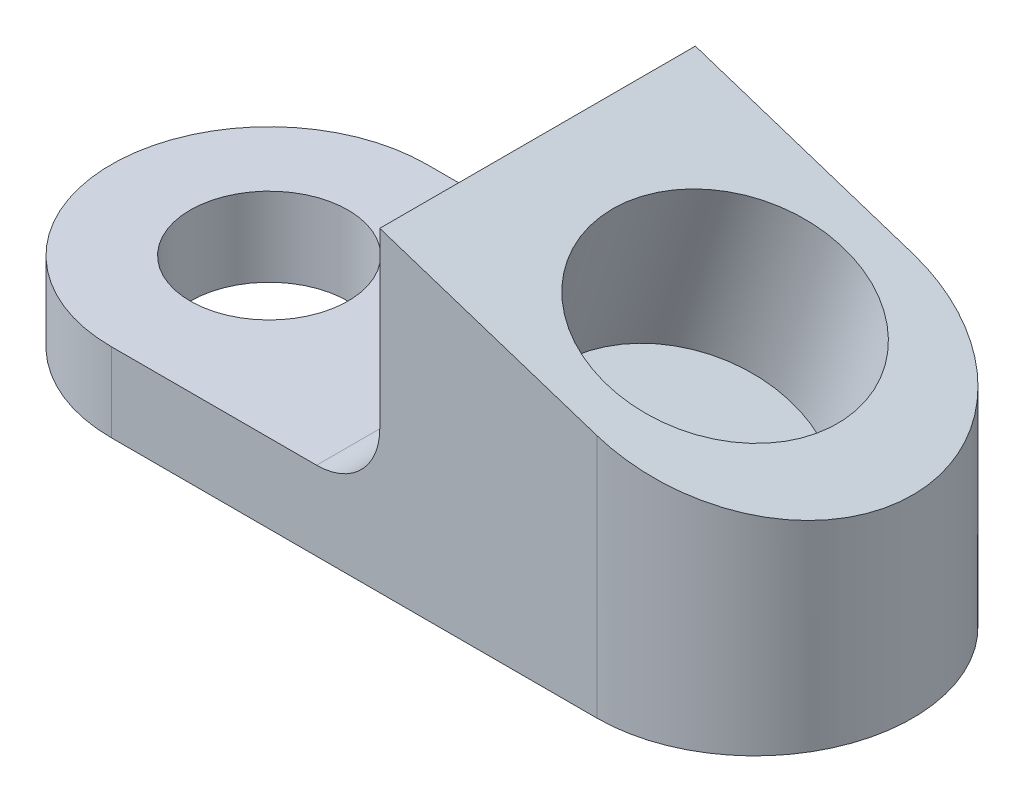
ISO-10303-21;
HEADER;
FILE_DESCRIPTION(('STEP AP214'),'2;1');
FILE_NAME('part.step','',(''),(''),'','','');
FILE_SCHEMA(('AUTOMOTIVE_DESIGN { 1 0 10303 214 1 1 1 1 }'));
ENDSEC;
DATA;
#1=APPLICATION_CONTEXT('core data for automotive mechanical design processes');
#2=APPLICATION_PROTOCOL_DEFINITION('international standard','automotive_design',2000,#1);
#3=PRODUCT_CONTEXT('',#1,'mechanical');
#4=PRODUCT('Part','Part','',(#3));
#5=PRODUCT_RELATED_PRODUCT_CATEGORY('part','',(#4));
#6=PRODUCT_DEFINITION_FORMATION('','',#4);
#7=PRODUCT_DEFINITION_CONTEXT('part definition',#1,'design');
#8=PRODUCT_DEFINITION('design','',#6,#7);
#9=PRODUCT_DEFINITION_SHAPE('','',#8);
#10=(LENGTH_UNIT() NAMED_UNIT(*) SI_UNIT(.MILLI.,.METRE.));
#11=(NAMED_UNIT(*) PLANE_ANGLE_UNIT() SI_UNIT($,.RADIAN.));
#12=(NAMED_UNIT(*) SI_UNIT($,.STERADIAN.) SOLID_ANGLE_UNIT());
#13=UNCERTAINTY_MEASURE_WITH_UNIT(LENGTH_MEASURE(1.E-05),#10,'distance_accuracy_value','');
#14=(GEOMETRIC_REPRESENTATION_CONTEXT(3) GLOBAL_UNCERTAINTY_ASSIGNED_CONTEXT((#13)) GLOBAL_UNIT_ASSIGNED_CONTEXT((#10,
#11,#12)) REPRESENTATION_CONTEXT('',''));
#15=CARTESIAN_POINT('',(0.,0.,0.));
#16=DIRECTION('',(0.,0.,1.));
#17=DIRECTION('',(1.,0.,0.));
#18=AXIS2_PLACEMENT_3D('',#15,#16,#17);
#19=CARTESIAN_POINT('',(0.,0.,12.7));
#20=DIRECTION('',(0.,0.,1.));
#21=DIRECTION('',(1.,0.,0.));
#22=AXIS2_PLACEMENT_3D('',#19,#20,#21);
#23=PLANE('',#22);
#24=DIRECTION('',(0.,-1.,0.));
#25=VECTOR('',#24,1.);
#26=CARTESIAN_POINT('',(43.2073246855607,25.4,12.7));
#27=LINE('',#26,#25);
#28=CARTESIAN_POINT('',(43.2073246855607,25.4,12.7));
#29=VERTEX_POINT('',#28);
#30=CARTESIAN_POINT('',(43.2073246855607,11.43,12.7));
#31=VERTEX_POINT('',#30);
#32=EDGE_CURVE('E121',#29,#31,#27,.T.);
#33=ORIENTED_EDGE('',*,*,#32,.T.);
#34=CARTESIAN_POINT('',(38.1273246855607,11.43,12.7));
#35=DIRECTION('',(0.,0.,1.));
#36=DIRECTION('',(1.,0.,0.));
#37=AXIS2_PLACEMENT_3D('',#34,#35,#36);
#38=CIRCLE('',#37,5.08);
#39=CARTESIAN_POINT('',(38.1273246855607,6.35000000000001,12.7));
#40=VERTEX_POINT('',#39);
#41=EDGE_CURVE('E11',#31,#40,#38,.F.);
#42=ORIENTED_EDGE('',*,*,#41,.T.);
#43=DIRECTION('',(-1.,0.,0.));
#44=VECTOR('',#43,1.);
#45=CARTESIAN_POINT('',(43.2073246855607,6.35000000000001,12.7));
#46=LINE('',#45,#44);
#47=CARTESIAN_POINT('',(21.6036623427803,6.35000000000001,12.7));
#48=VERTEX_POINT('',#47);
#49=EDGE_CURVE('E112',#40,#48,#46,.T.);
#50=ORIENTED_EDGE('',*,*,#49,.T.);
#51=DIRECTION('',(0.,1.,0.));
#52=VECTOR('',#51,1.);
#53=CARTESIAN_POINT('',(21.6036623427803,0.,12.7));
#54=LINE('',#53,#52);
#55=CARTESIAN_POINT('',(21.6036623427803,0.,12.7));
#56=VERTEX_POINT('',#55);
#57=EDGE_CURVE('E98',#56,#48,#54,.T.);
#58=ORIENTED_EDGE('',*,*,#57,.F.);
#59=DIRECTION('',(1.,0.,0.));
#60=VECTOR('',#59,1.);
#61=CARTESIAN_POINT('',(0.,0.,12.7));
#62=LINE('',#61,#60);
#63=CARTESIAN_POINT('',(60.6903098814732,0.,12.7));
#64=VERTEX_POINT('',#63);
#65=EDGE_CURVE('E109',#56,#64,#62,.T.);
#66=ORIENTED_EDGE('',*,*,#65,.T.);
#67=DIRECTION('',(0.,-1.,0.));
#68=VECTOR('',#67,1.);
#69=CARTESIAN_POINT('',(60.6903098814732,0.,12.7));
#70=LINE('',#69,#68);
#71=CARTESIAN_POINT('',(60.6903098814732,19.6937478874452,12.7));
#72=VERTEX_POINT('',#71);
#73=EDGE_CURVE('E140',#64,#72,#70,.F.);
#74=ORIENTED_EDGE('',*,*,#73,.T.);
#75=DIRECTION('',(-0.950645203020867,0.310280031541533,0.));
#76=VECTOR('',#75,1.);
#77=CARTESIAN_POINT('',(73.3903098814732,15.5486089985563,12.7));
#78=LINE('',#77,#76);
#79=EDGE_CURVE('E118',#72,#29,#78,.T.);
#80=ORIENTED_EDGE('',*,*,#79,.T.);
#81=EDGE_LOOP('',(#33,#42,#50,#58,#66,#74,#80));
#82=FACE_BOUND('',#81,.T.);
#83=ADVANCED_FACE('F35',(#82),#23,.T.);
#84=CARTESIAN_POINT('',(0.,0.,-12.7));
#85=DIRECTION('',(0.,0.,1.));
#86=DIRECTION('',(1.,0.,0.));
#87=AXIS2_PLACEMENT_3D('',#84,#85,#86);
#88=PLANE('',#87);
#89=DIRECTION('',(0.,1.,0.));
#90=VECTOR('',#89,1.);
#91=CARTESIAN_POINT('',(21.6036623427803,0.,-12.7));
#92=LINE('',#91,#90);
#93=CARTESIAN_POINT('',(21.6036623427803,0.,-12.7));
#94=VERTEX_POINT('',#93);
#95=CARTESIAN_POINT('',(21.6036623427803,6.35000000000001,-12.7));
#96=VERTEX_POINT('',#95);
#97=EDGE_CURVE('E101',#94,#96,#92,.T.);
#98=ORIENTED_EDGE('',*,*,#97,.T.);
#99=DIRECTION('',(-1.,0.,0.));
#100=VECTOR('',#99,1.);
#101=CARTESIAN_POINT('',(43.2073246855607,6.35000000000001,-12.7));
#102=LINE('',#101,#100);
#103=CARTESIAN_POINT('',(38.1273246855607,6.35000000000001,-12.7));
#104=VERTEX_POINT('',#103);
#105=EDGE_CURVE('E119',#104,#96,#102,.T.);
#106=ORIENTED_EDGE('',*,*,#105,.F.);
#107=CARTESIAN_POINT('',(38.1273246855607,11.43,-12.7));
#108=DIRECTION('',(0.,0.,1.));
#109=DIRECTION('',(1.,0.,0.));
#110=AXIS2_PLACEMENT_3D('',#107,#108,#109);
#111=CIRCLE('',#110,5.08);
#112=CARTESIAN_POINT('',(43.2073246855607,11.43,-12.7));
#113=VERTEX_POINT('',#112);
#114=EDGE_CURVE('E43',#104,#113,#111,.T.);
#115=ORIENTED_EDGE('',*,*,#114,.T.);
#116=DIRECTION('',(0.,-1.,0.));
#117=VECTOR('',#116,1.);
#118=CARTESIAN_POINT('',(43.2073246855607,25.4,-12.7));
#119=LINE('',#118,#117);
#120=CARTESIAN_POINT('',(43.2073246855607,25.4,-12.7));
#121=VERTEX_POINT('',#120);
#122=EDGE_CURVE('E123',#121,#113,#119,.T.);
#123=ORIENTED_EDGE('',*,*,#122,.F.);
#124=DIRECTION('',(-0.950645203020867,0.310280031541533,0.));
#125=VECTOR('',#124,1.);
#126=CARTESIAN_POINT('',(73.3903098814732,15.5486089985563,-12.7));
#127=LINE('',#126,#125);
#128=CARTESIAN_POINT('',(60.6903098814732,19.6937478874452,-12.7));
#129=VERTEX_POINT('',#128);
#130=EDGE_CURVE('E134',#129,#121,#127,.T.);
#131=ORIENTED_EDGE('',*,*,#130,.F.);
#132=DIRECTION('',(0.,1.,0.));
#133=VECTOR('',#132,1.);
#134=CARTESIAN_POINT('',(60.6903098814732,0.,-12.7));
#135=LINE('',#134,#133);
#136=CARTESIAN_POINT('',(60.6903098814732,0.,-12.7));
#137=VERTEX_POINT('',#136);
#138=EDGE_CURVE('E142',#129,#137,#135,.F.);
#139=ORIENTED_EDGE('',*,*,#138,.T.);
#140=DIRECTION('',(1.,0.,0.));
#141=VECTOR('',#140,1.);
#142=CARTESIAN_POINT('',(0.,0.,-12.7));
#143=LINE('',#142,#141);
#144=EDGE_CURVE('E132',#94,#137,#143,.T.);
#145=ORIENTED_EDGE('',*,*,#144,.F.);
#146=EDGE_LOOP('',(#98,#106,#115,#123,#131,#139,#145));
#147=FACE_BOUND('',#146,.T.);
#148=ADVANCED_FACE('F156',(#147),#88,.F.);
#149=CARTESIAN_POINT('',(60.6903098814732,0.,0.));
#150=DIRECTION('',(0.,1.,0.));
#151=DIRECTION('',(0.,0.,1.));
#152=AXIS2_PLACEMENT_3D('',#149,#150,#151);
#153=CYLINDRICAL_SURFACE('',#152,12.7);
#154=ORIENTED_EDGE('',*,*,#73,.F.);
#155=CARTESIAN_POINT('',(60.6903098814732,0.,0.));
#156=DIRECTION('',(0.,1.,0.));
#157=DIRECTION('',(0.,0.,1.));
#158=AXIS2_PLACEMENT_3D('',#155,#156,#157);
#159=CIRCLE('',#158,12.7);
#160=EDGE_CURVE('E116',#137,#64,#159,.F.);
#161=ORIENTED_EDGE('',*,*,#160,.F.);
#162=ORIENTED_EDGE('',*,*,#138,.F.);
#163=CARTESIAN_POINT('',(60.6903098814732,19.6937478874452,0.));
#164=DIRECTION('',(-0.310280031541533,-0.950645203020867,0.));
#165=DIRECTION('',(-0.950645203020867,0.310280031541533,0.));
#166=AXIS2_PLACEMENT_3D('',#163,#164,#165);
#167=ELLIPSE('',#166,13.3593479035535,12.7);
#168=EDGE_CURVE('E146',#72,#129,#167,.F.);
#169=ORIENTED_EDGE('',*,*,#168,.F.);
#170=EDGE_LOOP('',(#154,#161,#162,#169));
#171=FACE_BOUND('',#170,.T.);
#172=ADVANCED_FACE('F182',(#171),#153,.T.);
#173=CARTESIAN_POINT('',(0.,0.,12.7));
#174=DIRECTION('',(0.,1.,0.));
#175=DIRECTION('',(0.,0.,1.));
#176=AXIS2_PLACEMENT_3D('',#173,#174,#175);
#177=PLANE('',#176);
#178=CARTESIAN_POINT('',(21.6036623427803,0.,0.));
#179=DIRECTION('',(0.,1.,0.));
#180=DIRECTION('',(-1.,0.,0.));
#181=AXIS2_PLACEMENT_3D('',#178,#179,#180);
#182=CIRCLE('',#181,6.35);
#183=CARTESIAN_POINT('',(15.2536623427803,0.,0.));
#184=VERTEX_POINT('',#183);
#185=EDGE_CURVE('E160',#184,#184,#182,.T.);
#186=ORIENTED_EDGE('',*,*,#185,.T.);
#187=EDGE_LOOP('',(#186));
#188=FACE_BOUND('',#187,.T.);
#189=ORIENTED_EDGE('',*,*,#65,.F.);
#190=CARTESIAN_POINT('',(21.6036623427803,0.,0.));
#191=DIRECTION('',(0.,-1.,0.));
#192=DIRECTION('',(-1.,0.,0.));
#193=AXIS2_PLACEMENT_3D('',#190,#191,#192);
#194=CIRCLE('',#193,12.7);
#195=EDGE_CURVE('E94',#56,#94,#194,.T.);
#196=ORIENTED_EDGE('',*,*,#195,.T.);
#197=ORIENTED_EDGE('',*,*,#144,.T.);
#198=ORIENTED_EDGE('',*,*,#160,.T.);
#199=EDGE_LOOP('',(#189,#196,#197,#198));
#200=FACE_BOUND('',#199,.T.);
#201=ADVANCED_FACE('F114',(#188,#200),#177,.F.);
#202=CARTESIAN_POINT('',(73.3903098814732,15.5486089985563,12.7));
#203=DIRECTION('',(-0.310280031541533,-0.950645203020867,0.));
#204=DIRECTION('',(0.950645203020867,-0.310280031541533,0.));
#205=AXIS2_PLACEMENT_3D('',#202,#203,#204);
#206=PLANE('',#205);
#207=CARTESIAN_POINT('',(58.2988172835169,20.4743044992782,0.));
#208=DIRECTION('',(0.310280031541533,0.950645203020867,0.));
#209=DIRECTION('',(-0.950645203020867,0.310280031541533,0.));
#210=AXIS2_PLACEMENT_3D('',#207,#208,#209);
#211=CIRCLE('',#210,9.525);
#212=CARTESIAN_POINT('',(49.2439217247432,23.4297217997113,0.));
#213=VERTEX_POINT('',#212);
#214=EDGE_CURVE('E126',#213,#213,#211,.T.);
#215=ORIENTED_EDGE('',*,*,#214,.F.);
#216=EDGE_LOOP('',(#215));
#217=FACE_BOUND('',#216,.T.);
#218=ORIENTED_EDGE('',*,*,#79,.F.);
#219=ORIENTED_EDGE('',*,*,#168,.T.);
#220=ORIENTED_EDGE('',*,*,#130,.T.);
#221=DIRECTION('',(0.,0.,-1.));
#222=VECTOR('',#221,1.);
#223=CARTESIAN_POINT('',(43.2073246855607,25.4,12.7));
#224=LINE('',#223,#222);
#225=EDGE_CURVE('E131',#29,#121,#224,.T.);
#226=ORIENTED_EDGE('',*,*,#225,.F.);
#227=EDGE_LOOP('',(#218,#219,#220,#226));
#228=FACE_BOUND('',#227,.T.);
#229=ADVANCED_FACE('F173',(#217,#228),#206,.F.);
#230=CARTESIAN_POINT('',(43.2073246855607,25.4,12.7));
#231=DIRECTION('',(1.,0.,0.));
#232=DIRECTION('',(0.,1.,0.));
#233=AXIS2_PLACEMENT_3D('',#230,#231,#232);
#234=PLANE('',#233);
#235=ORIENTED_EDGE('',*,*,#122,.T.);
#236=DIRECTION('',(0.,0.,-1.));
#237=VECTOR('',#236,1.);
#238=CARTESIAN_POINT('',(43.2073246855607,11.43,12.7));
#239=LINE('',#238,#237);
#240=EDGE_CURVE('E50',#113,#31,#239,.F.);
#241=ORIENTED_EDGE('',*,*,#240,.T.);
#242=ORIENTED_EDGE('',*,*,#32,.F.);
#243=ORIENTED_EDGE('',*,*,#225,.T.);
#244=EDGE_LOOP('',(#235,#241,#242,#243));
#245=FACE_BOUND('',#244,.T.);
#246=ADVANCED_FACE('F176',(#245),#234,.F.);
#247=CARTESIAN_POINT('',(43.2073246855607,6.35000000000001,12.7));
#248=DIRECTION('',(0.,-1.,0.));
#249=DIRECTION('',(1.,0.,0.));
#250=AXIS2_PLACEMENT_3D('',#247,#248,#249);
#251=PLANE('',#250);
#252=CARTESIAN_POINT('',(21.6036623427803,6.35,0.));
#253=DIRECTION('',(0.,1.,0.));
#254=DIRECTION('',(-1.,0.,0.));
#255=AXIS2_PLACEMENT_3D('',#252,#253,#254);
#256=CIRCLE('',#255,6.35);
#257=CARTESIAN_POINT('',(15.2536623427803,6.35,0.));
#258=VERTEX_POINT('',#257);
#259=EDGE_CURVE('E157',#258,#258,#256,.T.);
#260=ORIENTED_EDGE('',*,*,#259,.F.);
#261=EDGE_LOOP('',(#260));
#262=FACE_BOUND('',#261,.T.);
#263=ORIENTED_EDGE('',*,*,#49,.F.);
#264=DIRECTION('',(0.,0.,-1.));
#265=VECTOR('',#264,1.);
#266=CARTESIAN_POINT('',(38.1273246855607,6.35000000000001,-12.7));
#267=LINE('',#266,#265);
#268=EDGE_CURVE('E148',#40,#104,#267,.T.);
#269=ORIENTED_EDGE('',*,*,#268,.T.);
#270=ORIENTED_EDGE('',*,*,#105,.T.);
#271=CARTESIAN_POINT('',(21.6036623427803,6.35000000000001,0.));
#272=DIRECTION('',(0.,-1.,0.));
#273=DIRECTION('',(-1.,0.,0.));
#274=AXIS2_PLACEMENT_3D('',#271,#272,#273);
#275=CIRCLE('',#274,12.7);
#276=EDGE_CURVE('E105',#48,#96,#275,.T.);
#277=ORIENTED_EDGE('',*,*,#276,.F.);
#278=EDGE_LOOP('',(#263,#269,#270,#277));
#279=FACE_BOUND('',#278,.T.);
#280=ADVANCED_FACE('F153',(#262,#279),#251,.F.);
#281=CARTESIAN_POINT('',(54.1033151205581,7.62,0.));
#282=DIRECTION('',(0.310280031541533,0.950645203020867,0.));
#283=DIRECTION('',(-0.950645203020867,0.310280031541533,0.));
#284=AXIS2_PLACEMENT_3D('',#281,#282,#283);
#285=CYLINDRICAL_SURFACE('',#284,9.525);
#286=CARTESIAN_POINT('',(54.1033151205581,7.62,0.));
#287=DIRECTION('',(0.310280031541533,0.950645203020867,0.));
#288=DIRECTION('',(-0.950645203020867,0.310280031541533,0.));
#289=AXIS2_PLACEMENT_3D('',#286,#287,#288);
#290=CIRCLE('',#289,9.525);
#291=CARTESIAN_POINT('',(45.0484195617843,10.5754173004331,0.));
#292=VERTEX_POINT('',#291);
#293=EDGE_CURVE('E135',#292,#292,#290,.T.);
#294=CARTESIAN_POINT('',(45.0484195617843,10.5754173004331,0.));
#295=CARTESIAN_POINT('',(45.0921227093152,10.7093163056339,0.));
#296=CARTESIAN_POINT('',(45.135825856846,10.8432153108347,0.));
#297=CARTESIAN_POINT('',(45.2232321519076,11.1110133212364,0.));
#298=CARTESIAN_POINT('',(45.2669352994384,11.2449123264372,0.));
#299=CARTESIAN_POINT('',(45.3543415945001,11.5127103368388,0.));
#300=CARTESIAN_POINT('',(45.3980447420309,11.6466093420396,0.));
#301=CARTESIAN_POINT('',(45.4854510370926,11.9144073524412,0.));
#302=CARTESIAN_POINT('',(45.5291541846234,12.0483063576421,0.));
#303=CARTESIAN_POINT('',(45.616560479685,12.3161043680437,0.));
#304=CARTESIAN_POINT('',(45.6602636272158,12.4500033732445,0.));
#305=CARTESIAN_POINT('',(45.7476699222775,12.7178013836461,0.));
#306=CARTESIAN_POINT('',(45.7913730698083,12.8517003888469,0.));
#307=CARTESIAN_POINT('',(45.8787793648699,13.1194983992486,0.));
#308=CARTESIAN_POINT('',(45.9224825124008,13.2533974044494,0.));
#309=CARTESIAN_POINT('',(46.0098888074624,13.521195414851,0.));
#310=CARTESIAN_POINT('',(46.0535919549932,13.6550944200518,0.));
#311=CARTESIAN_POINT('',(46.1409982500549,13.9228924304535,0.));
#312=CARTESIAN_POINT('',(46.1847013975857,14.0567914356543,0.));
#313=CARTESIAN_POINT('',(46.2721076926473,14.3245894460559,0.));
#314=CARTESIAN_POINT('',(46.3158108401782,14.4584884512567,0.));
#315=CARTESIAN_POINT('',(46.4032171352398,14.7262864616583,0.));
#316=CARTESIAN_POINT('',(46.4469202827706,14.8601854668592,0.));
#317=CARTESIAN_POINT('',(46.5343265778323,15.1279834772608,0.));
#318=CARTESIAN_POINT('',(46.5780297253631,15.2618824824616,0.));
#319=CARTESIAN_POINT('',(46.6654360204247,15.5296804928632,0.));
#320=CARTESIAN_POINT('',(46.7091391679555,15.663579498064,0.));
#321=CARTESIAN_POINT('',(46.7965454630172,15.9313775084657,0.));
#322=CARTESIAN_POINT('',(46.840248610548,16.0652765136665,0.));
#323=CARTESIAN_POINT('',(46.9276549056097,16.3330745240681,0.));
#324=CARTESIAN_POINT('',(46.9713580531405,16.4669735292689,0.));
#325=CARTESIAN_POINT('',(47.0587643482021,16.7347715396706,0.));
#326=CARTESIAN_POINT('',(47.1024674957329,16.8686705448714,0.));
#327=CARTESIAN_POINT('',(47.1898737907946,17.136468555273,0.));
#328=CARTESIAN_POINT('',(47.2335769383254,17.2703675604738,0.));
#329=CARTESIAN_POINT('',(47.320983233387,17.5381655708754,0.));
#330=CARTESIAN_POINT('',(47.3646863809179,17.6720645760763,0.));
#331=CARTESIAN_POINT('',(47.4520926759795,17.9398625864779,0.));
#332=CARTESIAN_POINT('',(47.4957958235103,18.0737615916787,0.));
#333=CARTESIAN_POINT('',(47.583202118572,18.3415596020803,0.));
#334=CARTESIAN_POINT('',(47.6269052661028,18.4754586072811,0.));
#335=CARTESIAN_POINT('',(47.7143115611644,18.7432566176828,0.));
#336=CARTESIAN_POINT('',(47.7580147086953,18.8771556228836,0.));
#337=CARTESIAN_POINT('',(47.8454210037569,19.1449536332852,0.));
#338=CARTESIAN_POINT('',(47.8891241512877,19.278852638486,0.));
#339=CARTESIAN_POINT('',(47.9765304463494,19.5466506488877,0.));
#340=CARTESIAN_POINT('',(48.0202335938802,19.6805496540885,0.));
#341=CARTESIAN_POINT('',(48.1076398889418,19.9483476644901,0.));
#342=CARTESIAN_POINT('',(48.1513430364727,20.0822466696909,0.));
#343=CARTESIAN_POINT('',(48.2387493315343,20.3500446800925,0.));
#344=CARTESIAN_POINT('',(48.2824524790651,20.4839436852934,0.));
#345=CARTESIAN_POINT('',(48.3698587741268,20.751741695695,0.));
#346=CARTESIAN_POINT('',(48.4135619216576,20.8856407008958,0.));
#347=CARTESIAN_POINT('',(48.5009682167192,21.1534387112974,0.));
#348=CARTESIAN_POINT('',(48.54467136425,21.2873377164982,0.));
#349=CARTESIAN_POINT('',(48.6320776593117,21.5551357268999,0.));
#350=CARTESIAN_POINT('',(48.6757808068425,21.6890347321007,0.));
#351=CARTESIAN_POINT('',(48.7631871019042,21.9568327425023,0.));
#352=CARTESIAN_POINT('',(48.806890249435,22.0907317477031,0.));
#353=CARTESIAN_POINT('',(48.8942965444966,22.3585297581048,0.));
#354=CARTESIAN_POINT('',(48.9379996920274,22.4924287633056,0.));
#355=CARTESIAN_POINT('',(49.0254059870891,22.7602267737072,0.));
#356=CARTESIAN_POINT('',(49.0691091346199,22.894125778908,0.));
#357=CARTESIAN_POINT('',(49.1565154296815,23.1619237893096,0.));
#358=CARTESIAN_POINT('',(49.2002185772124,23.2958227945105,0.));
#359=CARTESIAN_POINT('',(49.2439217247432,23.4297217997113,0.));
#360=B_SPLINE_CURVE_WITH_KNOTS('',3,(#294,#295,#296,#297,#298,#299,#300,#301,#302,#303,#304,
#305,#306,#307,#308,#309,#310,#311,#312,#313,#314,#315,#316,#317,#318,#319,#320,#321,#322,#323,
#324,#325,#326,#327,#328,#329,#330,#331,#332,#333,#334,#335,#336,#337,#338,#339,#340,#341,#342,
#343,#344,#345,#346,#347,#348,#349,#350,#351,#352,#353,#354,#355,#356,#357,#358,#359),
.UNSPECIFIED.,.F.,.F.,(4,2,2,2,2,2,2,2,2,2,2,2,2,2,2,2,2,2,2,2,2,2,2,2,2,2,2,2,2,2,2,2,4),(0.,
0.422551982933245,0.845103965866487,1.26765594879973,1.69020793173297,2.11275991466622,
2.53531189759946,2.9578638805327,3.38041586346595,3.80296784639919,4.22551982933243,
4.64807181226568,5.07062379519892,5.49317577813216,5.9157277610654,6.33827974399865,
6.76083172693189,7.18338370986514,7.60593569279838,8.02848767573162,8.45103965866486,
8.87359164159811,9.29614362453135,9.7186956074646,10.1412475903978,10.5637995733311,
10.9863515562643,11.4089035391976,11.8314555221308,12.2540075050641,12.6765594879973,
13.0991114709305,13.5216634538638),.UNSPECIFIED.);
#361=EDGE_CURVE('BSEAM171',#292,#213,#360,.T.);
#362=ORIENTED_EDGE('',*,*,#293,.F.);
#363=ORIENTED_EDGE('',*,*,#214,.T.);
#364=ORIENTED_EDGE('',*,*,#361,.T.);
#365=ORIENTED_EDGE('',*,*,#361,.F.);
#366=EDGE_LOOP('',(#362,#364,#363,#365));
#367=FACE_BOUND('',#366,.T.);
#368=ADVANCED_FACE('F171',(#367),#285,.F.);
#369=CARTESIAN_POINT('',(54.1033151205581,7.62,0.));
#370=DIRECTION('',(0.310280031541533,0.950645203020867,0.));
#371=DIRECTION('',(-0.950645203020867,0.310280031541533,0.));
#372=AXIS2_PLACEMENT_3D('',#369,#370,#371);
#373=PLANE('',#372);
#374=ORIENTED_EDGE('',*,*,#293,.T.);
#375=EDGE_LOOP('',(#374));
#376=FACE_BOUND('',#375,.T.);
#377=ADVANCED_FACE('F238',(#376),#373,.T.);
#378=CARTESIAN_POINT('',(21.6036623427803,0.,0.));
#379=DIRECTION('',(0.,1.,0.));
#380=DIRECTION('',(-1.,0.,0.));
#381=AXIS2_PLACEMENT_3D('',#378,#379,#380);
#382=CYLINDRICAL_SURFACE('',#381,6.35);
#383=ORIENTED_EDGE('',*,*,#185,.F.);
#384=EDGE_LOOP('',(#383));
#385=FACE_BOUND('',#384,.T.);
#386=ORIENTED_EDGE('',*,*,#259,.T.);
#387=EDGE_LOOP('',(#386));
#388=FACE_BOUND('',#387,.T.);
#389=ADVANCED_FACE('F188',(#385,#388),#382,.F.);
#390=CARTESIAN_POINT('',(21.6036623427803,0.,0.));
#391=DIRECTION('',(0.,1.,0.));
#392=DIRECTION('',(-1.,0.,0.));
#393=AXIS2_PLACEMENT_3D('',#390,#391,#392);
#394=CYLINDRICAL_SURFACE('',#393,12.7);
#395=ORIENTED_EDGE('',*,*,#276,.T.);
#396=ORIENTED_EDGE('',*,*,#97,.F.);
#397=ORIENTED_EDGE('',*,*,#195,.F.);
#398=ORIENTED_EDGE('',*,*,#57,.T.);
#399=EDGE_LOOP('',(#395,#396,#397,#398));
#400=FACE_BOUND('',#399,.T.);
#401=ADVANCED_FACE('F97',(#400),#394,.T.);
#402=CARTESIAN_POINT('',(38.1273246855607,11.43,12.7));
#403=DIRECTION('',(0.,0.,1.));
#404=DIRECTION('',(1.,0.,0.));
#405=AXIS2_PLACEMENT_3D('',#402,#403,#404);
#406=CYLINDRICAL_SURFACE('',#405,5.08);
#407=ORIENTED_EDGE('',*,*,#41,.F.);
#408=ORIENTED_EDGE('',*,*,#240,.F.);
#409=ORIENTED_EDGE('',*,*,#114,.F.);
#410=ORIENTED_EDGE('',*,*,#268,.F.);
#411=EDGE_LOOP('',(#407,#408,#409,#410));
#412=FACE_BOUND('',#411,.T.);
#413=ADVANCED_FACE('F37',(#412),#406,.F.);
#414=CLOSED_SHELL('',(#83,#148,#172,#201,#229,#246,#280,#368,#377,#389,#401,#413));
#415=MANIFOLD_SOLID_BREP('B2',#414);
#416=ADVANCED_BREP_SHAPE_REPRESENTATION('',(#18,#415),#14);
#417=SHAPE_DEFINITION_REPRESENTATION(#9,#416);
ENDSEC;
END-ISO-10303-21;
